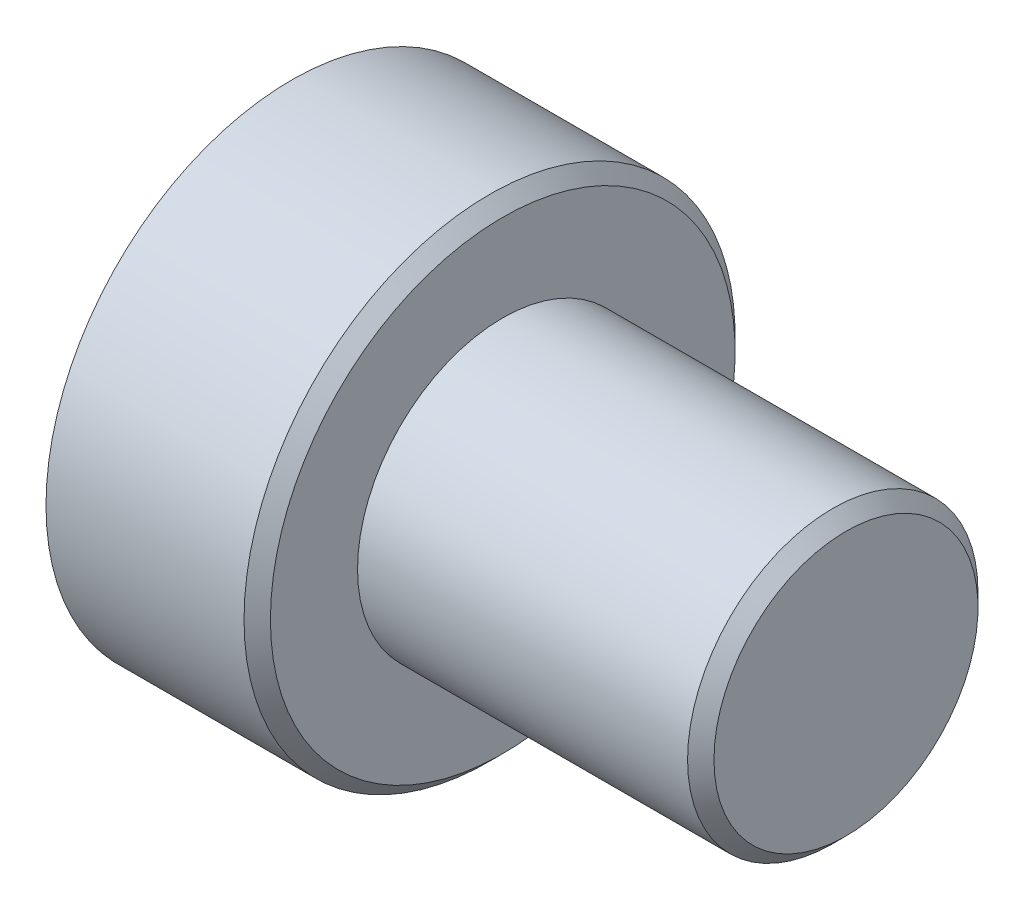
ISO-10303-21;
HEADER;
FILE_DESCRIPTION(('STEP AP214'),'2;1');
FILE_NAME('part.step','',(''),(''),'','','');
FILE_SCHEMA(('AUTOMOTIVE_DESIGN { 1 0 10303 214 1 1 1 1 }'));
ENDSEC;
DATA;
#1=APPLICATION_CONTEXT('core data for automotive mechanical design processes');
#2=APPLICATION_PROTOCOL_DEFINITION('international standard','automotive_design',2000,#1);
#3=PRODUCT_CONTEXT('',#1,'mechanical');
#4=PRODUCT('Part','Part','',(#3));
#5=PRODUCT_RELATED_PRODUCT_CATEGORY('part','',(#4));
#6=PRODUCT_DEFINITION_FORMATION('','',#4);
#7=PRODUCT_DEFINITION_CONTEXT('part definition',#1,'design');
#8=PRODUCT_DEFINITION('design','',#6,#7);
#9=PRODUCT_DEFINITION_SHAPE('','',#8);
#10=(LENGTH_UNIT() NAMED_UNIT(*) SI_UNIT(.MILLI.,.METRE.));
#11=(NAMED_UNIT(*) PLANE_ANGLE_UNIT() SI_UNIT($,.RADIAN.));
#12=(NAMED_UNIT(*) SI_UNIT($,.STERADIAN.) SOLID_ANGLE_UNIT());
#13=UNCERTAINTY_MEASURE_WITH_UNIT(LENGTH_MEASURE(1.E-05),#10,'distance_accuracy_value','');
#14=(GEOMETRIC_REPRESENTATION_CONTEXT(3) GLOBAL_UNCERTAINTY_ASSIGNED_CONTEXT((#13)) GLOBAL_UNIT_ASSIGNED_CONTEXT((#10,
#11,#12)) REPRESENTATION_CONTEXT('',''));
#15=CARTESIAN_POINT('',(0.,0.,0.));
#16=DIRECTION('',(0.,0.,1.));
#17=DIRECTION('',(1.,0.,0.));
#18=AXIS2_PLACEMENT_3D('',#15,#16,#17);
#19=CARTESIAN_POINT('',(2.032,2.3622,0.));
#20=DIRECTION('',(-1.,0.,0.));
#21=DIRECTION('',(0.,0.,1.));
#22=AXIS2_PLACEMENT_3D('',#19,#20,#21);
#23=PLANE('',#22);
#24=CARTESIAN_POINT('',(2.032,0.,0.));
#25=DIRECTION('',(-1.,0.,0.));
#26=DIRECTION('',(0.,0.,1.));
#27=AXIS2_PLACEMENT_3D('',#24,#25,#26);
#28=CIRCLE('',#27,2.2352);
#29=CARTESIAN_POINT('',(2.032,0.,2.2352));
#30=VERTEX_POINT('',#29);
#31=EDGE_CURVE('E71',#30,#30,#28,.F.);
#32=ORIENTED_EDGE('',*,*,#31,.T.);
#33=EDGE_LOOP('',(#32));
#34=FACE_BOUND('',#33,.T.);
#35=CARTESIAN_POINT('',(2.032,0.,0.));
#36=DIRECTION('',(-1.,0.,0.));
#37=DIRECTION('',(0.,0.,1.));
#38=AXIS2_PLACEMENT_3D('',#35,#36,#37);
#39=CIRCLE('',#38,1.397);
#40=CARTESIAN_POINT('',(2.032,0.,1.397));
#41=VERTEX_POINT('',#40);
#42=EDGE_CURVE('E55',#41,#41,#39,.T.);
#43=ORIENTED_EDGE('',*,*,#42,.T.);
#44=EDGE_LOOP('',(#43));
#45=FACE_BOUND('',#44,.T.);
#46=ADVANCED_FACE('F34',(#34,#45),#23,.F.);
#47=CARTESIAN_POINT('',(0.,0.,0.));
#48=DIRECTION('',(-1.,0.,0.));
#49=DIRECTION('',(0.,0.,1.));
#50=AXIS2_PLACEMENT_3D('',#47,#48,#49);
#51=CYLINDRICAL_SURFACE('',#50,2.3622);
#52=CARTESIAN_POINT('',(1.905,0.,0.));
#53=DIRECTION('',(-1.,0.,0.));
#54=DIRECTION('',(0.,0.,1.));
#55=AXIS2_PLACEMENT_3D('',#52,#53,#54);
#56=CIRCLE('',#55,2.3622);
#57=CARTESIAN_POINT('',(1.905,0.,2.3622));
#58=VERTEX_POINT('',#57);
#59=EDGE_CURVE('E68',#58,#58,#56,.T.);
#60=ORIENTED_EDGE('',*,*,#59,.T.);
#61=EDGE_LOOP('',(#60));
#62=FACE_BOUND('',#61,.T.);
#63=CARTESIAN_POINT('',(0.,0.,0.));
#64=DIRECTION('',(-1.,0.,0.));
#65=DIRECTION('',(0.,0.,1.));
#66=AXIS2_PLACEMENT_3D('',#63,#64,#65);
#67=CIRCLE('',#66,2.3622);
#68=CARTESIAN_POINT('',(0.,0.,2.3622));
#69=VERTEX_POINT('',#68);
#70=EDGE_CURVE('E65',#69,#69,#67,.T.);
#71=ORIENTED_EDGE('',*,*,#70,.F.);
#72=EDGE_LOOP('',(#71));
#73=FACE_BOUND('',#72,.T.);
#74=ADVANCED_FACE('F88',(#62,#73),#51,.T.);
#75=CARTESIAN_POINT('',(0.,1.8542,0.));
#76=DIRECTION('',(1.,0.,0.));
#77=DIRECTION('',(0.,0.,-1.));
#78=AXIS2_PLACEMENT_3D('',#75,#76,#77);
#79=PLANE('',#78);
#80=CARTESIAN_POINT('',(0.,0.,0.));
#81=DIRECTION('',(-1.,0.,0.));
#82=DIRECTION('',(0.,0.,1.));
#83=AXIS2_PLACEMENT_3D('',#80,#81,#82);
#84=CIRCLE('',#83,1.8542);
#85=CARTESIAN_POINT('',(0.,0.,1.8542));
#86=VERTEX_POINT('',#85);
#87=EDGE_CURVE('E58',#86,#86,#84,.T.);
#88=ORIENTED_EDGE('',*,*,#87,.F.);
#89=EDGE_LOOP('',(#88));
#90=FACE_BOUND('',#89,.T.);
#91=ORIENTED_EDGE('',*,*,#70,.T.);
#92=EDGE_LOOP('',(#91));
#93=FACE_BOUND('',#92,.T.);
#94=ADVANCED_FACE('F94',(#90,#93),#79,.F.);
#95=CARTESIAN_POINT('',(0.,0.,0.));
#96=DIRECTION('',(-1.,0.,0.));
#97=DIRECTION('',(0.,0.,1.));
#98=AXIS2_PLACEMENT_3D('',#95,#96,#97);
#99=CYLINDRICAL_SURFACE('',#98,1.8542);
#100=CARTESIAN_POINT('',(1.524,0.,0.));
#101=DIRECTION('',(-1.,0.,0.));
#102=DIRECTION('',(0.,0.,1.));
#103=AXIS2_PLACEMENT_3D('',#100,#101,#102);
#104=CIRCLE('',#103,1.8542);
#105=CARTESIAN_POINT('',(1.524,0.,1.8542));
#106=VERTEX_POINT('',#105);
#107=EDGE_CURVE('E54',#106,#106,#104,.T.);
#108=ORIENTED_EDGE('',*,*,#107,.F.);
#109=EDGE_LOOP('',(#108));
#110=FACE_BOUND('',#109,.T.);
#111=ORIENTED_EDGE('',*,*,#87,.T.);
#112=EDGE_LOOP('',(#111));
#113=FACE_BOUND('',#112,.T.);
#114=ADVANCED_FACE('F101',(#110,#113),#99,.F.);
#115=CARTESIAN_POINT('',(1.524,1.8542,0.));
#116=DIRECTION('',(1.,0.,0.));
#117=DIRECTION('',(0.,0.,-1.));
#118=AXIS2_PLACEMENT_3D('',#115,#116,#117);
#119=PLANE('',#118);
#120=CARTESIAN_POINT('',(1.524,0.,0.));
#121=DIRECTION('',(-1.,0.,0.));
#122=DIRECTION('',(0.,0.,1.));
#123=AXIS2_PLACEMENT_3D('',#120,#121,#122);
#124=CIRCLE('',#123,0.634090482775551);
#125=CARTESIAN_POINT('',(1.524,0.,0.634090482775551));
#126=VERTEX_POINT('',#125);
#127=EDGE_CURVE('E52',#126,#126,#124,.T.);
#128=ORIENTED_EDGE('',*,*,#127,.F.);
#129=EDGE_LOOP('',(#128));
#130=FACE_BOUND('',#129,.T.);
#131=ORIENTED_EDGE('',*,*,#107,.T.);
#132=EDGE_LOOP('',(#131));
#133=FACE_BOUND('',#132,.T.);
#134=ADVANCED_FACE('F48',(#130,#133),#119,.F.);
#135=CARTESIAN_POINT('',(1.524,0.,0.));
#136=DIRECTION('',(-1.,0.,0.));
#137=DIRECTION('',(0.,0.,1.));
#138=AXIS2_PLACEMENT_3D('',#135,#136,#137);
#139=CONICAL_SURFACE('',#138,0.634090482775551,1.02974425867666);
#140=CARTESIAN_POINT('',(1.905,0.,0.));
#141=VERTEX_POINT('',#140);
#142=VERTEX_LOOP('',#141);
#143=FACE_BOUND('',#142,.T.);
#144=ORIENTED_EDGE('',*,*,#127,.T.);
#145=EDGE_LOOP('',(#144));
#146=FACE_BOUND('',#145,.T.);
#147=ADVANCED_FACE('F44',(#143,#146),#139,.F.);
#148=CARTESIAN_POINT('',(5.334,1.397,0.));
#149=DIRECTION('',(-1.,0.,0.));
#150=DIRECTION('',(0.,0.,1.));
#151=AXIS2_PLACEMENT_3D('',#148,#149,#150);
#152=PLANE('',#151);
#153=CARTESIAN_POINT('',(5.334,0.,0.));
#154=DIRECTION('',(-1.,0.,0.));
#155=DIRECTION('',(0.,0.,1.));
#156=AXIS2_PLACEMENT_3D('',#153,#154,#155);
#157=CIRCLE('',#156,1.27);
#158=CARTESIAN_POINT('',(5.334,0.,1.27));
#159=VERTEX_POINT('',#158);
#160=EDGE_CURVE('E11',#159,#159,#157,.F.);
#161=ORIENTED_EDGE('',*,*,#160,.T.);
#162=EDGE_LOOP('',(#161));
#163=FACE_BOUND('',#162,.T.);
#164=ADVANCED_FACE('F47',(#163),#152,.F.);
#165=CARTESIAN_POINT('',(0.,0.,0.));
#166=DIRECTION('',(-1.,0.,0.));
#167=DIRECTION('',(0.,0.,1.));
#168=AXIS2_PLACEMENT_3D('',#165,#166,#167);
#169=CYLINDRICAL_SURFACE('',#168,1.397);
#170=CARTESIAN_POINT('',(5.207,0.,0.));
#171=DIRECTION('',(-1.,0.,0.));
#172=DIRECTION('',(0.,0.,1.));
#173=AXIS2_PLACEMENT_3D('',#170,#171,#172);
#174=CIRCLE('',#173,1.397);
#175=CARTESIAN_POINT('',(5.207,0.,1.397));
#176=VERTEX_POINT('',#175);
#177=EDGE_CURVE('E41',#176,#176,#174,.T.);
#178=ORIENTED_EDGE('',*,*,#177,.T.);
#179=EDGE_LOOP('',(#178));
#180=FACE_BOUND('',#179,.T.);
#181=ORIENTED_EDGE('',*,*,#42,.F.);
#182=EDGE_LOOP('',(#181));
#183=FACE_BOUND('',#182,.T.);
#184=ADVANCED_FACE('F76',(#180,#183),#169,.T.);
#185=CARTESIAN_POINT('',(1.905,0.,0.));
#186=DIRECTION('',(-1.,0.,0.));
#187=DIRECTION('',(0.,0.,1.));
#188=AXIS2_PLACEMENT_3D('',#185,#186,#187);
#189=CONICAL_SURFACE('',#188,2.3622,0.785398163397448);
#190=ORIENTED_EDGE('',*,*,#31,.F.);
#191=EDGE_LOOP('',(#190));
#192=FACE_BOUND('',#191,.T.);
#193=ORIENTED_EDGE('',*,*,#59,.F.);
#194=EDGE_LOOP('',(#193));
#195=FACE_BOUND('',#194,.T.);
#196=ADVANCED_FACE('F80',(#192,#195),#189,.T.);
#197=CARTESIAN_POINT('',(5.207,0.,0.));
#198=DIRECTION('',(-1.,0.,0.));
#199=DIRECTION('',(0.,0.,1.));
#200=AXIS2_PLACEMENT_3D('',#197,#198,#199);
#201=CONICAL_SURFACE('',#200,1.397,0.785398163397449);
#202=ORIENTED_EDGE('',*,*,#160,.F.);
#203=EDGE_LOOP('',(#202));
#204=FACE_BOUND('',#203,.T.);
#205=ORIENTED_EDGE('',*,*,#177,.F.);
#206=EDGE_LOOP('',(#205));
#207=FACE_BOUND('',#206,.T.);
#208=ADVANCED_FACE('F36',(#204,#207),#201,.T.);
#209=CLOSED_SHELL('',(#46,#74,#94,#114,#134,#147,#164,#184,#196,#208));
#210=MANIFOLD_SOLID_BREP('B2',#209);
#211=ADVANCED_BREP_SHAPE_REPRESENTATION('',(#18,#210),#14);
#212=SHAPE_DEFINITION_REPRESENTATION(#9,#211);
ENDSEC;
END-ISO-10303-21;
